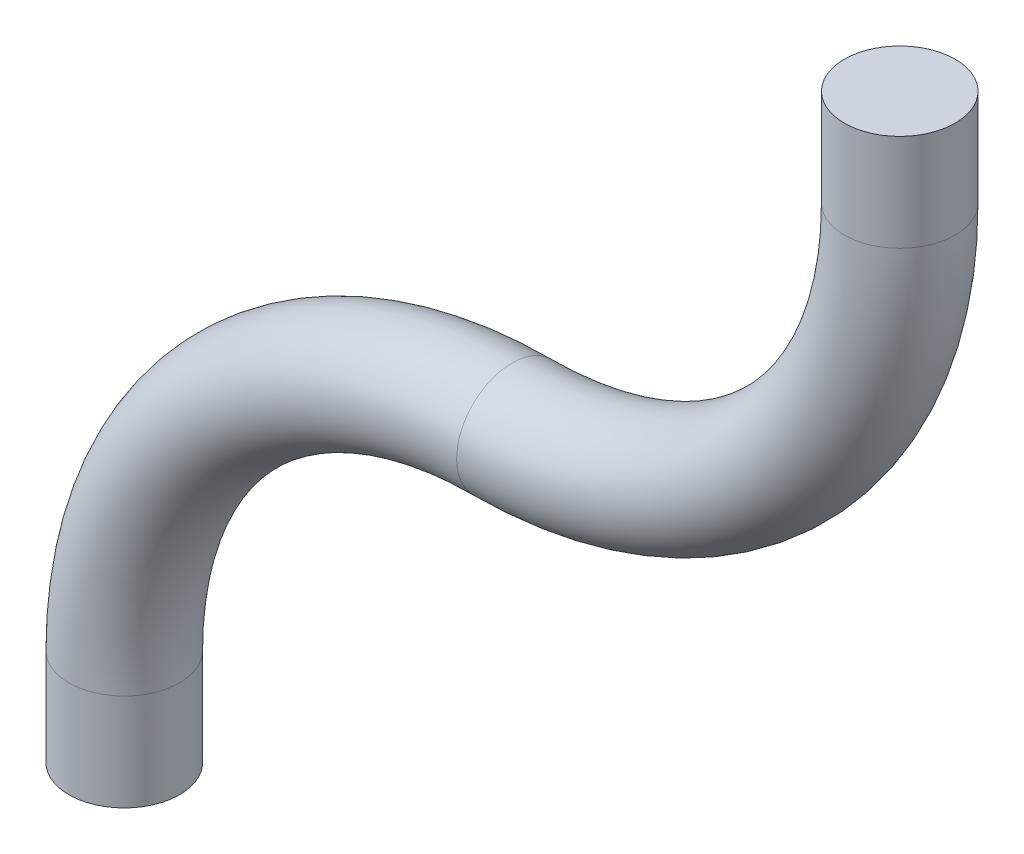
ISO-10303-21;
HEADER;
FILE_DESCRIPTION(('STEP AP214'),'2;1');
FILE_NAME('part.step','',(''),(''),'','','');
FILE_SCHEMA(('AUTOMOTIVE_DESIGN { 1 0 10303 214 1 1 1 1 }'));
ENDSEC;
DATA;
#1=APPLICATION_CONTEXT('core data for automotive mechanical design processes');
#2=APPLICATION_PROTOCOL_DEFINITION('international standard','automotive_design',2000,#1);
#3=PRODUCT_CONTEXT('',#1,'mechanical');
#4=PRODUCT('Part','Part','',(#3));
#5=PRODUCT_RELATED_PRODUCT_CATEGORY('part','',(#4));
#6=PRODUCT_DEFINITION_FORMATION('','',#4);
#7=PRODUCT_DEFINITION_CONTEXT('part definition',#1,'design');
#8=PRODUCT_DEFINITION('design','',#6,#7);
#9=PRODUCT_DEFINITION_SHAPE('','',#8);
#10=(LENGTH_UNIT() NAMED_UNIT(*) SI_UNIT(.MILLI.,.METRE.));
#11=(NAMED_UNIT(*) PLANE_ANGLE_UNIT() SI_UNIT($,.RADIAN.));
#12=(NAMED_UNIT(*) SI_UNIT($,.STERADIAN.) SOLID_ANGLE_UNIT());
#13=UNCERTAINTY_MEASURE_WITH_UNIT(LENGTH_MEASURE(1.E-05),#10,'distance_accuracy_value','');
#14=(GEOMETRIC_REPRESENTATION_CONTEXT(3) GLOBAL_UNCERTAINTY_ASSIGNED_CONTEXT((#13)) GLOBAL_UNIT_ASSIGNED_CONTEXT((#10,
#11,#12)) REPRESENTATION_CONTEXT('',''));
#15=CARTESIAN_POINT('',(0.,0.,0.));
#16=DIRECTION('',(0.,0.,1.));
#17=DIRECTION('',(1.,0.,0.));
#18=AXIS2_PLACEMENT_3D('',#15,#16,#17);
#19=CARTESIAN_POINT('',(0.,-5.60000000000001,0.));
#20=DIRECTION('',(0.,-1.,0.));
#21=DIRECTION('',(0.,0.,-1.));
#22=AXIS2_PLACEMENT_3D('',#19,#20,#21);
#23=PLANE('',#22);
#24=CARTESIAN_POINT('',(0.,-5.60000000000001,0.));
#25=DIRECTION('',(0.,-1.,0.));
#26=DIRECTION('',(0.,0.,-1.));
#27=AXIS2_PLACEMENT_3D('',#24,#25,#26);
#28=CIRCLE('',#27,3.2);
#29=CARTESIAN_POINT('',(0.,-5.60000000000001,-3.2));
#30=VERTEX_POINT('',#29);
#31=EDGE_CURVE('E76',#30,#30,#28,.T.);
#32=ORIENTED_EDGE('',*,*,#31,.T.);
#33=EDGE_LOOP('',(#32));
#34=FACE_BOUND('',#33,.T.);
#35=ADVANCED_FACE('F53',(#34),#23,.T.);
#36=CARTESIAN_POINT('',(44.8,50.4,0.));
#37=DIRECTION('',(0.,-1.,0.));
#38=DIRECTION('',(0.,0.,-1.));
#39=AXIS2_PLACEMENT_3D('',#36,#37,#38);
#40=PLANE('',#39);
#41=CARTESIAN_POINT('',(44.8,50.4,0.));
#42=DIRECTION('',(0.,-1.,0.));
#43=DIRECTION('',(0.,0.,-1.));
#44=AXIS2_PLACEMENT_3D('',#41,#42,#43);
#45=CIRCLE('',#44,3.2);
#46=CARTESIAN_POINT('',(44.8,50.4,-3.2));
#47=VERTEX_POINT('',#46);
#48=EDGE_CURVE('E11',#47,#47,#45,.T.);
#49=ORIENTED_EDGE('',*,*,#48,.F.);
#50=EDGE_LOOP('',(#49));
#51=FACE_BOUND('',#50,.T.);
#52=ADVANCED_FACE('F85',(#51),#40,.F.);
#53=CARTESIAN_POINT('',(0.,-5.60000000000001,0.));
#54=DIRECTION('',(0.,1.,0.));
#55=DIRECTION('',(-1.,0.,0.));
#56=AXIS2_PLACEMENT_3D('',#53,#54,#55);
#57=CYLINDRICAL_SURFACE('',#56,3.2);
#58=CARTESIAN_POINT('',(0.,0.,0.));
#59=DIRECTION('',(0.,-1.,0.));
#60=DIRECTION('',(0.,0.,-1.));
#61=AXIS2_PLACEMENT_3D('',#58,#59,#60);
#62=CIRCLE('',#61,3.2);
#63=CARTESIAN_POINT('',(-3.2,0.,0.));
#64=VERTEX_POINT('',#63);
#65=EDGE_CURVE('E70',#64,#64,#62,.T.);
#66=ORIENTED_EDGE('',*,*,#65,.T.);
#67=EDGE_LOOP('',(#66));
#68=FACE_BOUND('',#67,.T.);
#69=ORIENTED_EDGE('',*,*,#31,.F.);
#70=EDGE_LOOP('',(#69));
#71=FACE_BOUND('',#70,.T.);
#72=ADVANCED_FACE('F82',(#68,#71),#57,.T.);
#73=CARTESIAN_POINT('',(22.4,0.,0.));
#74=DIRECTION('',(0.,0.,-1.));
#75=DIRECTION('',(-1.,0.,0.));
#76=AXIS2_PLACEMENT_3D('',#73,#74,#75);
#77=TOROIDAL_SURFACE('',#76,22.4,3.2);
#78=CARTESIAN_POINT('',(22.4,22.4,0.));
#79=DIRECTION('',(-1.,0.,0.));
#80=DIRECTION('',(0.,0.,-1.));
#81=AXIS2_PLACEMENT_3D('',#78,#79,#80);
#82=CIRCLE('',#81,3.2);
#83=CARTESIAN_POINT('',(22.4,25.6,0.));
#84=VERTEX_POINT('',#83);
#85=EDGE_CURVE('E65',#84,#84,#82,.T.);
#86=CARTESIAN_POINT('',(22.4,0.,0.));
#87=DIRECTION('',(0.,0.,-1.));
#88=DIRECTION('',(-1.,0.,0.));
#89=AXIS2_PLACEMENT_3D('',#86,#87,#88);
#90=CIRCLE('',#89,25.6);
#91=EDGE_CURVE('',#64,#84,#90,.T.);
#92=ORIENTED_EDGE('',*,*,#65,.F.);
#93=ORIENTED_EDGE('',*,*,#85,.T.);
#94=ORIENTED_EDGE('',*,*,#91,.T.);
#95=ORIENTED_EDGE('',*,*,#91,.F.);
#96=EDGE_LOOP('',(#92,#94,#93,#95));
#97=FACE_BOUND('',#96,.T.);
#98=ADVANCED_FACE('F84',(#97),#77,.T.);
#99=CARTESIAN_POINT('',(22.4,44.8,0.));
#100=DIRECTION('',(0.,0.,1.));
#101=DIRECTION('',(1.,0.,0.));
#102=AXIS2_PLACEMENT_3D('',#99,#100,#101);
#103=TOROIDAL_SURFACE('',#102,22.4,3.2);
#104=CARTESIAN_POINT('',(44.8,44.8,0.));
#105=DIRECTION('',(0.,-1.,0.));
#106=DIRECTION('',(0.,0.,-1.));
#107=AXIS2_PLACEMENT_3D('',#104,#105,#106);
#108=CIRCLE('',#107,3.2);
#109=CARTESIAN_POINT('',(44.8,44.8,-3.2));
#110=VERTEX_POINT('',#109);
#111=EDGE_CURVE('E60',#110,#110,#108,.T.);
#112=ORIENTED_EDGE('',*,*,#111,.T.);
#113=EDGE_LOOP('',(#112));
#114=FACE_BOUND('',#113,.T.);
#115=ORIENTED_EDGE('',*,*,#85,.F.);
#116=EDGE_LOOP('',(#115));
#117=FACE_BOUND('',#116,.T.);
#118=ADVANCED_FACE('F92',(#114,#117),#103,.T.);
#119=CARTESIAN_POINT('',(44.8,44.8,0.));
#120=DIRECTION('',(0.,1.,0.));
#121=DIRECTION('',(0.,0.,1.));
#122=AXIS2_PLACEMENT_3D('',#119,#120,#121);
#123=CYLINDRICAL_SURFACE('',#122,3.2);
#124=ORIENTED_EDGE('',*,*,#48,.T.);
#125=EDGE_LOOP('',(#124));
#126=FACE_BOUND('',#125,.T.);
#127=ORIENTED_EDGE('',*,*,#111,.F.);
#128=EDGE_LOOP('',(#127));
#129=FACE_BOUND('',#128,.T.);
#130=ADVANCED_FACE('F96',(#126,#129),#123,.T.);
#131=CLOSED_SHELL('',(#35,#52,#72,#98,#118,#130));
#132=MANIFOLD_SOLID_BREP('B2',#131);
#133=ADVANCED_BREP_SHAPE_REPRESENTATION('',(#18,#132),#14);
#134=SHAPE_DEFINITION_REPRESENTATION(#9,#133);
ENDSEC;
END-ISO-10303-21;
